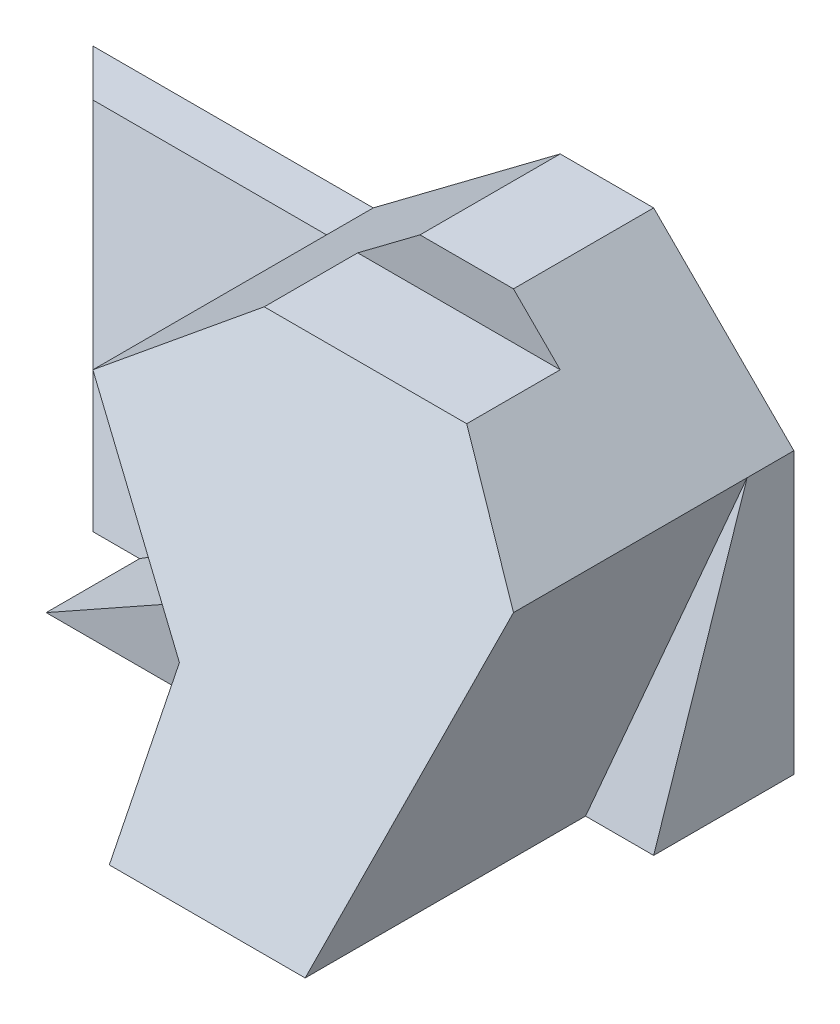
ISO-10303-21;
HEADER;
FILE_DESCRIPTION(('STEP AP214'),'2;1');
FILE_NAME('part.step','',(''),(''),'','','');
FILE_SCHEMA(('AUTOMOTIVE_DESIGN { 1 0 10303 214 1 1 1 1 }'));
ENDSEC;
DATA;
#1=APPLICATION_CONTEXT('core data for automotive mechanical design processes');
#2=APPLICATION_PROTOCOL_DEFINITION('international standard','automotive_design',2000,#1);
#3=PRODUCT_CONTEXT('',#1,'mechanical');
#4=PRODUCT('Part','Part','',(#3));
#5=PRODUCT_RELATED_PRODUCT_CATEGORY('part','',(#4));
#6=PRODUCT_DEFINITION_FORMATION('','',#4);
#7=PRODUCT_DEFINITION_CONTEXT('part definition',#1,'design');
#8=PRODUCT_DEFINITION('design','',#6,#7);
#9=PRODUCT_DEFINITION_SHAPE('','',#8);
#10=(LENGTH_UNIT() NAMED_UNIT(*) SI_UNIT(.MILLI.,.METRE.));
#11=(NAMED_UNIT(*) PLANE_ANGLE_UNIT() SI_UNIT($,.RADIAN.));
#12=(NAMED_UNIT(*) SI_UNIT($,.STERADIAN.) SOLID_ANGLE_UNIT());
#13=UNCERTAINTY_MEASURE_WITH_UNIT(LENGTH_MEASURE(1.E-05),#10,'distance_accuracy_value','');
#14=(GEOMETRIC_REPRESENTATION_CONTEXT(3) GLOBAL_UNCERTAINTY_ASSIGNED_CONTEXT((#13)) GLOBAL_UNIT_ASSIGNED_CONTEXT((#10,
#11,#12)) REPRESENTATION_CONTEXT('',''));
#15=CARTESIAN_POINT('',(0.,0.,0.));
#16=DIRECTION('',(0.,0.,1.));
#17=DIRECTION('',(1.,0.,0.));
#18=AXIS2_PLACEMENT_3D('',#15,#16,#17);
#19=CARTESIAN_POINT('',(0.,-4.5,9.));
#20=DIRECTION('',(0.,1.,0.));
#21=DIRECTION('',(0.,0.,1.));
#22=AXIS2_PLACEMENT_3D('',#19,#20,#21);
#23=PLANE('',#22);
#24=DIRECTION('',(0.,0.,1.));
#25=VECTOR('',#24,1.);
#26=CARTESIAN_POINT('',(1.85176640565367,-4.5,5.));
#27=LINE('',#26,#25);
#28=CARTESIAN_POINT('',(1.85176640565367,-4.5,5.));
#29=VERTEX_POINT('',#28);
#30=CARTESIAN_POINT('',(1.85176640565367,-4.5,9.));
#31=VERTEX_POINT('',#30);
#32=EDGE_CURVE('E286',#29,#31,#27,.T.);
#33=ORIENTED_EDGE('',*,*,#32,.F.);
#34=DIRECTION('',(1.,0.,0.));
#35=VECTOR('',#34,1.);
#36=CARTESIAN_POINT('',(0.,-4.5,5.));
#37=LINE('',#36,#35);
#38=CARTESIAN_POINT('',(-3.50000000000001,-4.5,5.));
#39=VERTEX_POINT('',#38);
#40=EDGE_CURVE('E293',#39,#29,#37,.T.);
#41=ORIENTED_EDGE('',*,*,#40,.F.);
#42=DIRECTION('',(0.,0.,1.));
#43=VECTOR('',#42,1.);
#44=CARTESIAN_POINT('',(-3.50000000000001,-4.5,3.));
#45=LINE('',#44,#43);
#46=CARTESIAN_POINT('',(-3.50000000000001,-4.5,3.));
#47=VERTEX_POINT('',#46);
#48=EDGE_CURVE('E188',#47,#39,#45,.T.);
#49=ORIENTED_EDGE('',*,*,#48,.F.);
#50=DIRECTION('',(1.,0.,0.));
#51=VECTOR('',#50,1.);
#52=CARTESIAN_POINT('',(-4.50000000000001,-4.5,3.));
#53=LINE('',#52,#51);
#54=CARTESIAN_POINT('',(-4.50000000000001,-4.5,3.));
#55=VERTEX_POINT('',#54);
#56=EDGE_CURVE('E158',#55,#47,#53,.T.);
#57=ORIENTED_EDGE('',*,*,#56,.F.);
#58=DIRECTION('',(0.707106781186548,0.,0.707106781186548));
#59=VECTOR('',#58,1.);
#60=CARTESIAN_POINT('',(-7.50000000000001,-4.5,0.));
#61=LINE('',#60,#59);
#62=CARTESIAN_POINT('',(-7.50000000000001,-4.5,0.));
#63=VERTEX_POINT('',#62);
#64=EDGE_CURVE('E140',#63,#55,#61,.T.);
#65=ORIENTED_EDGE('',*,*,#64,.F.);
#66=DIRECTION('',(1.,0.,0.));
#67=VECTOR('',#66,1.);
#68=CARTESIAN_POINT('',(0.,-4.5,0.));
#69=LINE('',#68,#67);
#70=CARTESIAN_POINT('',(7.49999999999999,-4.5,0.));
#71=VERTEX_POINT('',#70);
#72=EDGE_CURVE('E155',#63,#71,#69,.T.);
#73=ORIENTED_EDGE('',*,*,#72,.T.);
#74=DIRECTION('',(0.,0.,-1.));
#75=VECTOR('',#74,1.);
#76=CARTESIAN_POINT('',(7.49999999999999,-4.5,9.));
#77=LINE('',#76,#75);
#78=CARTESIAN_POINT('',(7.49999999999999,-4.5,3.));
#79=VERTEX_POINT('',#78);
#80=EDGE_CURVE('E43',#79,#71,#77,.T.);
#81=ORIENTED_EDGE('',*,*,#80,.F.);
#82=DIRECTION('',(-1.,0.,0.));
#83=VECTOR('',#82,1.);
#84=CARTESIAN_POINT('',(7.49999999999999,-4.5,3.));
#85=LINE('',#84,#83);
#86=CARTESIAN_POINT('',(6.04272144633455,-4.5,3.));
#87=VERTEX_POINT('',#86);
#88=EDGE_CURVE('E277',#79,#87,#85,.T.);
#89=ORIENTED_EDGE('',*,*,#88,.T.);
#90=DIRECTION('',(0.,0.,1.));
#91=VECTOR('',#90,1.);
#92=CARTESIAN_POINT('',(6.04272144633455,-4.5,3.));
#93=LINE('',#92,#91);
#94=CARTESIAN_POINT('',(6.04272144633455,-4.5,9.));
#95=VERTEX_POINT('',#94);
#96=EDGE_CURVE('E269',#87,#95,#93,.T.);
#97=ORIENTED_EDGE('',*,*,#96,.T.);
#98=DIRECTION('',(1.,0.,0.));
#99=VECTOR('',#98,1.);
#100=CARTESIAN_POINT('',(0.,-4.5,9.));
#101=LINE('',#100,#99);
#102=EDGE_CURVE('E168',#31,#95,#101,.T.);
#103=ORIENTED_EDGE('',*,*,#102,.F.);
#104=EDGE_LOOP('',(#33,#41,#49,#57,#65,#73,#81,#89,#97,#103));
#105=FACE_BOUND('',#104,.T.);
#106=ADVANCED_FACE('F39',(#105),#23,.F.);
#107=CARTESIAN_POINT('',(11.5,3.5,5.));
#108=DIRECTION('',(0.,-0.447213595499958,-0.894427190999916));
#109=DIRECTION('',(0.,0.894427190999916,-0.447213595499958));
#110=AXIS2_PLACEMENT_3D('',#107,#108,#109);
#111=PLANE('',#110);
#112=DIRECTION('',(0.,0.894427190999916,-0.447213595499958));
#113=VECTOR('',#112,1.);
#114=CARTESIAN_POINT('',(1.85176640565367,3.5,5.));
#115=LINE('',#114,#113);
#116=CARTESIAN_POINT('',(1.85176640565367,-1.5,7.5));
#117=VERTEX_POINT('',#116);
#118=EDGE_CURVE('E280',#31,#117,#115,.T.);
#119=ORIENTED_EDGE('',*,*,#118,.F.);
#120=ORIENTED_EDGE('',*,*,#102,.T.);
#121=DIRECTION('',(-0.212286835420554,-0.87404086838414,0.43702043419207));
#122=VECTOR('',#121,1.);
#123=CARTESIAN_POINT('',(8.14413122691524,4.15205807892426,4.67397096053787));
#124=LINE('',#123,#122);
#125=CARTESIAN_POINT('',(7.49999999999999,1.5,6.));
#126=VERTEX_POINT('',#125);
#127=EDGE_CURVE('E192',#126,#95,#124,.T.);
#128=ORIENTED_EDGE('',*,*,#127,.F.);
#129=DIRECTION('',(-0.666666666666667,0.666666666666667,-0.333333333333333));
#130=VECTOR('',#129,1.);
#131=CARTESIAN_POINT('',(5.49999999999999,3.5,5.));
#132=LINE('',#131,#130);
#133=CARTESIAN_POINT('',(5.49999999999999,3.5,5.));
#134=VERTEX_POINT('',#133);
#135=EDGE_CURVE('E227',#126,#134,#132,.T.);
#136=ORIENTED_EDGE('',*,*,#135,.T.);
#137=DIRECTION('',(-1.,0.,0.));
#138=VECTOR('',#137,1.);
#139=CARTESIAN_POINT('',(11.5,3.5,5.));
#140=LINE('',#139,#138);
#141=CARTESIAN_POINT('',(1.16666666666666,3.5,5.));
#142=VERTEX_POINT('',#141);
#143=EDGE_CURVE('E226',#134,#142,#140,.T.);
#144=ORIENTED_EDGE('',*,*,#143,.T.);
#145=DIRECTION('',(0.766261028176921,0.574695771132691,-0.287347885566345));
#146=VECTOR('',#145,1.);
#147=CARTESIAN_POINT('',(-1.94036697247707,1.1697247706422,6.1651376146789));
#148=LINE('',#147,#146);
#149=CARTESIAN_POINT('',(-1.50000000000001,1.5,6.));
#150=VERTEX_POINT('',#149);
#151=EDGE_CURVE('E219',#150,#142,#148,.T.);
#152=ORIENTED_EDGE('',*,*,#151,.F.);
#153=DIRECTION('',(0.706860462866664,-0.632675769117753,0.316337884558877));
#154=VECTOR('',#153,1.);
#155=CARTESIAN_POINT('',(3.87743856402521,-3.31307875896842,8.40653937948421));
#156=LINE('',#155,#154);
#157=EDGE_CURVE('E66',#150,#117,#156,.T.);
#158=ORIENTED_EDGE('',*,*,#157,.T.);
#159=EDGE_LOOP('',(#119,#120,#128,#136,#144,#152,#158));
#160=FACE_BOUND('',#159,.T.);
#161=ADVANCED_FACE('F311',(#160),#111,.F.);
#162=CARTESIAN_POINT('',(-3.50000000000001,-4.5,3.));
#163=DIRECTION('',(0.488976907666917,-0.87229672919741,0.));
#164=DIRECTION('',(0.87229672919741,0.488976907666917,0.));
#165=AXIS2_PLACEMENT_3D('',#162,#163,#164);
#166=PLANE('',#165);
#167=DIRECTION('',(-0.87229672919741,-0.488976907666917,0.));
#168=VECTOR('',#167,1.);
#169=CARTESIAN_POINT('',(1.08255385063887,-1.93119177672004,5.));
#170=LINE('',#169,#168);
#171=CARTESIAN_POINT('',(1.85176640565367,-1.5,5.));
#172=VERTEX_POINT('',#171);
#173=EDGE_CURVE('E296',#172,#39,#170,.T.);
#174=ORIENTED_EDGE('',*,*,#173,.F.);
#175=DIRECTION('',(0.,0.,1.));
#176=VECTOR('',#175,1.);
#177=CARTESIAN_POINT('',(1.85176640565367,-1.5,2.));
#178=LINE('',#177,#176);
#179=CARTESIAN_POINT('',(1.85176640565367,-1.5,2.));
#180=VERTEX_POINT('',#179);
#181=EDGE_CURVE('E12',#180,#172,#178,.T.);
#182=ORIENTED_EDGE('',*,*,#181,.F.);
#183=DIRECTION('',(0.860935670718548,0.48260832338032,-0.160869441126773));
#184=VECTOR('',#183,1.);
#185=CARTESIAN_POINT('',(-3.50000000000001,-4.5,3.));
#186=LINE('',#185,#184);
#187=EDGE_CURVE('E82',#47,#180,#186,.T.);
#188=ORIENTED_EDGE('',*,*,#187,.F.);
#189=ORIENTED_EDGE('',*,*,#48,.T.);
#190=EDGE_LOOP('',(#174,#182,#188,#189));
#191=FACE_BOUND('',#190,.T.);
#192=ADVANCED_FACE('F308',(#191),#166,.F.);
#193=CARTESIAN_POINT('',(7.49999999999999,0.,9.));
#194=DIRECTION('',(-1.,0.,0.));
#195=DIRECTION('',(0.,0.,1.));
#196=AXIS2_PLACEMENT_3D('',#193,#194,#195);
#197=PLANE('',#196);
#198=DIRECTION('',(0.,-0.948683298050514,0.316227766016838));
#199=VECTOR('',#198,1.);
#200=CARTESIAN_POINT('',(7.49999999999999,1.5,1.));
#201=LINE('',#200,#199);
#202=CARTESIAN_POINT('',(7.49999999999999,1.5,1.));
#203=VERTEX_POINT('',#202);
#204=EDGE_CURVE('E266',#203,#79,#201,.T.);
#205=ORIENTED_EDGE('',*,*,#204,.T.);
#206=ORIENTED_EDGE('',*,*,#80,.T.);
#207=DIRECTION('',(0.,1.,0.));
#208=VECTOR('',#207,1.);
#209=CARTESIAN_POINT('',(7.49999999999999,0.,0.));
#210=LINE('',#209,#208);
#211=CARTESIAN_POINT('',(7.49999999999999,1.5,0.));
#212=VERTEX_POINT('',#211);
#213=EDGE_CURVE('E165',#71,#212,#210,.T.);
#214=ORIENTED_EDGE('',*,*,#213,.T.);
#215=DIRECTION('',(0.,0.,-1.));
#216=VECTOR('',#215,1.);
#217=CARTESIAN_POINT('',(7.49999999999999,1.5,9.));
#218=LINE('',#217,#216);
#219=EDGE_CURVE('E198',#203,#212,#218,.T.);
#220=ORIENTED_EDGE('',*,*,#219,.F.);
#221=EDGE_LOOP('',(#205,#206,#214,#220));
#222=FACE_BOUND('',#221,.T.);
#223=ADVANCED_FACE('F310',(#222),#197,.F.);
#224=CARTESIAN_POINT('',(0.,1.5,9.));
#225=DIRECTION('',(0.,-1.,0.));
#226=DIRECTION('',(1.,0.,0.));
#227=AXIS2_PLACEMENT_3D('',#224,#225,#226);
#228=PLANE('',#227);
#229=DIRECTION('',(-1.,0.,0.));
#230=VECTOR('',#229,1.);
#231=CARTESIAN_POINT('',(-1.50000000000001,1.5,1.));
#232=LINE('',#231,#230);
#233=CARTESIAN_POINT('',(-1.50000000000001,1.5,1.));
#234=VERTEX_POINT('',#233);
#235=CARTESIAN_POINT('',(-6.50000000000001,1.5,1.));
#236=VERTEX_POINT('',#235);
#237=EDGE_CURVE('E250',#234,#236,#232,.T.);
#238=ORIENTED_EDGE('',*,*,#237,.F.);
#239=DIRECTION('',(0.,0.,-1.));
#240=VECTOR('',#239,1.);
#241=CARTESIAN_POINT('',(-1.50000000000001,1.5,9.));
#242=LINE('',#241,#240);
#243=CARTESIAN_POINT('',(-1.50000000000001,1.5,0.));
#244=VERTEX_POINT('',#243);
#245=EDGE_CURVE('E170',#234,#244,#242,.T.);
#246=ORIENTED_EDGE('',*,*,#245,.T.);
#247=DIRECTION('',(-1.,0.,0.));
#248=VECTOR('',#247,1.);
#249=CARTESIAN_POINT('',(0.,1.5,0.));
#250=LINE('',#249,#248);
#251=CARTESIAN_POINT('',(-7.50000000000001,1.5,0.));
#252=VERTEX_POINT('',#251);
#253=EDGE_CURVE('E166',#244,#252,#250,.T.);
#254=ORIENTED_EDGE('',*,*,#253,.T.);
#255=DIRECTION('',(-0.707106781186547,0.,-0.707106781186548));
#256=VECTOR('',#255,1.);
#257=CARTESIAN_POINT('',(-6.50000000000001,1.5,1.));
#258=LINE('',#257,#256);
#259=EDGE_CURVE('E143',#236,#252,#258,.T.);
#260=ORIENTED_EDGE('',*,*,#259,.F.);
#261=EDGE_LOOP('',(#238,#246,#254,#260));
#262=FACE_BOUND('',#261,.T.);
#263=ADVANCED_FACE('F41',(#262),#228,.F.);
#264=CARTESIAN_POINT('',(-1.26,1.68,9.));
#265=DIRECTION('',(0.6,-0.8,0.));
#266=DIRECTION('',(0.8,0.6,0.));
#267=AXIS2_PLACEMENT_3D('',#264,#265,#266);
#268=PLANE('',#267);
#269=EDGE_CURVE('E49',#150,#234,#242,.T.);
#270=ORIENTED_EDGE('',*,*,#269,.F.);
#271=ORIENTED_EDGE('',*,*,#151,.T.);
#272=DIRECTION('',(0.,0.,-1.));
#273=VECTOR('',#272,1.);
#274=CARTESIAN_POINT('',(1.16666666666666,3.5,9.));
#275=LINE('',#274,#273);
#276=CARTESIAN_POINT('',(1.16666666666666,3.5,3.));
#277=VERTEX_POINT('',#276);
#278=EDGE_CURVE('E216',#142,#277,#275,.T.);
#279=ORIENTED_EDGE('',*,*,#278,.T.);
#280=DIRECTION('',(0.8,0.6,0.));
#281=VECTOR('',#280,1.);
#282=CARTESIAN_POINT('',(-1.26,1.68,3.));
#283=LINE('',#282,#281);
#284=CARTESIAN_POINT('',(2.49999999999999,4.5,3.));
#285=VERTEX_POINT('',#284);
#286=EDGE_CURVE('E209',#277,#285,#283,.T.);
#287=ORIENTED_EDGE('',*,*,#286,.T.);
#288=DIRECTION('',(0.,0.,-1.));
#289=VECTOR('',#288,1.);
#290=CARTESIAN_POINT('',(2.49999999999999,4.5,9.));
#291=LINE('',#290,#289);
#292=CARTESIAN_POINT('',(2.49999999999999,4.5,0.));
#293=VERTEX_POINT('',#292);
#294=EDGE_CURVE('E206',#285,#293,#291,.T.);
#295=ORIENTED_EDGE('',*,*,#294,.T.);
#296=DIRECTION('',(-0.8,-0.6,0.));
#297=VECTOR('',#296,1.);
#298=CARTESIAN_POINT('',(-1.26,1.68,0.));
#299=LINE('',#298,#297);
#300=EDGE_CURVE('E208',#293,#244,#299,.T.);
#301=ORIENTED_EDGE('',*,*,#300,.T.);
#302=ORIENTED_EDGE('',*,*,#245,.F.);
#303=EDGE_LOOP('',(#270,#271,#279,#287,#295,#301,#302));
#304=FACE_BOUND('',#303,.T.);
#305=ADVANCED_FACE('F262',(#304),#268,.F.);
#306=CARTESIAN_POINT('',(4.5,4.5,9.));
#307=DIRECTION('',(0.707106781186547,0.707106781186547,0.));
#308=DIRECTION('',(-0.707106781186548,0.707106781186548,0.));
#309=AXIS2_PLACEMENT_3D('',#306,#307,#308);
#310=PLANE('',#309);
#311=ORIENTED_EDGE('',*,*,#135,.F.);
#312=EDGE_CURVE('E199',#126,#203,#218,.T.);
#313=ORIENTED_EDGE('',*,*,#312,.T.);
#314=ORIENTED_EDGE('',*,*,#219,.T.);
#315=DIRECTION('',(0.707106781186548,-0.707106781186548,0.));
#316=VECTOR('',#315,1.);
#317=CARTESIAN_POINT('',(4.5,4.5,0.));
#318=LINE('',#317,#316);
#319=CARTESIAN_POINT('',(4.49999999999999,4.5,0.));
#320=VERTEX_POINT('',#319);
#321=EDGE_CURVE('E149',#320,#212,#318,.T.);
#322=ORIENTED_EDGE('',*,*,#321,.F.);
#323=DIRECTION('',(0.,0.,-1.));
#324=VECTOR('',#323,1.);
#325=CARTESIAN_POINT('',(4.49999999999999,4.5,9.));
#326=LINE('',#325,#324);
#327=CARTESIAN_POINT('',(4.49999999999999,4.5,3.));
#328=VERTEX_POINT('',#327);
#329=EDGE_CURVE('E202',#328,#320,#326,.T.);
#330=ORIENTED_EDGE('',*,*,#329,.F.);
#331=DIRECTION('',(-0.707106781186548,0.707106781186548,0.));
#332=VECTOR('',#331,1.);
#333=CARTESIAN_POINT('',(4.5,4.5,3.));
#334=LINE('',#333,#332);
#335=CARTESIAN_POINT('',(5.49999999999999,3.5,3.));
#336=VERTEX_POINT('',#335);
#337=EDGE_CURVE('E222',#336,#328,#334,.T.);
#338=ORIENTED_EDGE('',*,*,#337,.F.);
#339=DIRECTION('',(0.,0.,-1.));
#340=VECTOR('',#339,1.);
#341=CARTESIAN_POINT('',(5.49999999999999,3.5,9.));
#342=LINE('',#341,#340);
#343=EDGE_CURVE('E148',#134,#336,#342,.T.);
#344=ORIENTED_EDGE('',*,*,#343,.F.);
#345=EDGE_LOOP('',(#311,#313,#314,#322,#330,#338,#344));
#346=FACE_BOUND('',#345,.T.);
#347=ADVANCED_FACE('F353',(#346),#310,.T.);
#348=CARTESIAN_POINT('',(0.,4.5,9.));
#349=DIRECTION('',(0.,1.,0.));
#350=DIRECTION('',(0.,0.,1.));
#351=AXIS2_PLACEMENT_3D('',#348,#349,#350);
#352=PLANE('',#351);
#353=DIRECTION('',(-1.,0.,0.));
#354=VECTOR('',#353,1.);
#355=CARTESIAN_POINT('',(11.5,4.5,3.));
#356=LINE('',#355,#354);
#357=EDGE_CURVE('E191',#328,#285,#356,.T.);
#358=ORIENTED_EDGE('',*,*,#357,.F.);
#359=ORIENTED_EDGE('',*,*,#329,.T.);
#360=DIRECTION('',(1.,0.,0.));
#361=VECTOR('',#360,1.);
#362=CARTESIAN_POINT('',(0.,4.5,0.));
#363=LINE('',#362,#361);
#364=EDGE_CURVE('E205',#293,#320,#363,.T.);
#365=ORIENTED_EDGE('',*,*,#364,.F.);
#366=ORIENTED_EDGE('',*,*,#294,.F.);
#367=EDGE_LOOP('',(#358,#359,#365,#366));
#368=FACE_BOUND('',#367,.T.);
#369=ADVANCED_FACE('F350',(#368),#352,.T.);
#370=CARTESIAN_POINT('',(0.,0.,0.));
#371=DIRECTION('',(0.,0.,1.));
#372=DIRECTION('',(1.,0.,0.));
#373=AXIS2_PLACEMENT_3D('',#370,#371,#372);
#374=PLANE('',#373);
#375=ORIENTED_EDGE('',*,*,#300,.F.);
#376=ORIENTED_EDGE('',*,*,#364,.T.);
#377=ORIENTED_EDGE('',*,*,#321,.T.);
#378=ORIENTED_EDGE('',*,*,#213,.F.);
#379=ORIENTED_EDGE('',*,*,#72,.F.);
#380=DIRECTION('',(0.,1.,0.));
#381=VECTOR('',#380,1.);
#382=CARTESIAN_POINT('',(-7.50000000000001,0.,0.));
#383=LINE('',#382,#381);
#384=EDGE_CURVE('E137',#63,#252,#383,.T.);
#385=ORIENTED_EDGE('',*,*,#384,.T.);
#386=ORIENTED_EDGE('',*,*,#253,.F.);
#387=EDGE_LOOP('',(#375,#376,#377,#378,#379,#385,#386));
#388=FACE_BOUND('',#387,.T.);
#389=ADVANCED_FACE('F162',(#388),#374,.F.);
#390=CARTESIAN_POINT('',(11.5,3.5,3.));
#391=DIRECTION('',(0.,-1.,0.));
#392=DIRECTION('',(0.,0.,-1.));
#393=AXIS2_PLACEMENT_3D('',#390,#391,#392);
#394=PLANE('',#393);
#395=ORIENTED_EDGE('',*,*,#143,.F.);
#396=ORIENTED_EDGE('',*,*,#343,.T.);
#397=DIRECTION('',(-1.,0.,0.));
#398=VECTOR('',#397,1.);
#399=CARTESIAN_POINT('',(11.5,3.5,3.));
#400=LINE('',#399,#398);
#401=EDGE_CURVE('E180',#336,#277,#400,.T.);
#402=ORIENTED_EDGE('',*,*,#401,.T.);
#403=ORIENTED_EDGE('',*,*,#278,.F.);
#404=EDGE_LOOP('',(#395,#396,#402,#403));
#405=FACE_BOUND('',#404,.T.);
#406=ADVANCED_FACE('F341',(#405),#394,.F.);
#407=CARTESIAN_POINT('',(11.5,4.5,3.));
#408=DIRECTION('',(0.,0.,-1.));
#409=DIRECTION('',(-1.,0.,0.));
#410=AXIS2_PLACEMENT_3D('',#407,#408,#409);
#411=PLANE('',#410);
#412=ORIENTED_EDGE('',*,*,#401,.F.);
#413=ORIENTED_EDGE('',*,*,#337,.T.);
#414=ORIENTED_EDGE('',*,*,#357,.T.);
#415=ORIENTED_EDGE('',*,*,#286,.F.);
#416=EDGE_LOOP('',(#412,#413,#414,#415));
#417=FACE_BOUND('',#416,.T.);
#418=ADVANCED_FACE('F338',(#417),#411,.F.);
#419=CARTESIAN_POINT('',(-3.75,0.,3.75));
#420=DIRECTION('',(-0.707106781186548,0.,0.707106781186547));
#421=DIRECTION('',(0.707106781186547,0.,0.707106781186548));
#422=AXIS2_PLACEMENT_3D('',#419,#420,#421);
#423=PLANE('',#422);
#424=DIRECTION('',(-0.301511344577764,0.904534033733291,-0.301511344577764));
#425=VECTOR('',#424,1.);
#426=CARTESIAN_POINT('',(-4.50000000000001,-4.5,3.));
#427=LINE('',#426,#425);
#428=EDGE_CURVE('E91',#55,#236,#427,.T.);
#429=ORIENTED_EDGE('',*,*,#428,.T.);
#430=ORIENTED_EDGE('',*,*,#259,.T.);
#431=ORIENTED_EDGE('',*,*,#384,.F.);
#432=ORIENTED_EDGE('',*,*,#64,.T.);
#433=EDGE_LOOP('',(#429,#430,#431,#432));
#434=FACE_BOUND('',#433,.T.);
#435=ADVANCED_FACE('F139',(#434),#423,.T.);
#436=CARTESIAN_POINT('',(0.,0.45,1.34999999999999));
#437=DIRECTION('',(0.,0.316227766016839,0.948683298050513));
#438=DIRECTION('',(0.,-0.948683298050513,0.316227766016839));
#439=AXIS2_PLACEMENT_3D('',#436,#437,#438);
#440=PLANE('',#439);
#441=DIRECTION('',(-0.727368317697291,0.651031333630872,-0.217010444543624));
#442=VECTOR('',#441,1.);
#443=CARTESIAN_POINT('',(1.85176640565367,-1.5,2.));
#444=LINE('',#443,#442);
#445=EDGE_CURVE('E159',#180,#234,#444,.T.);
#446=ORIENTED_EDGE('',*,*,#445,.T.);
#447=ORIENTED_EDGE('',*,*,#237,.T.);
#448=ORIENTED_EDGE('',*,*,#428,.F.);
#449=ORIENTED_EDGE('',*,*,#56,.T.);
#450=ORIENTED_EDGE('',*,*,#187,.T.);
#451=EDGE_LOOP('',(#446,#447,#448,#449,#450));
#452=FACE_BOUND('',#451,.T.);
#453=ADVANCED_FACE('F257',(#452),#440,.T.);
#454=CARTESIAN_POINT('',(1.85176640565367,-1.5,2.));
#455=DIRECTION('',(0.66692462638464,0.745125185939724,0.));
#456=DIRECTION('',(-0.745125185939724,0.66692462638464,0.));
#457=AXIS2_PLACEMENT_3D('',#454,#455,#456);
#458=PLANE('',#457);
#459=ORIENTED_EDGE('',*,*,#269,.T.);
#460=ORIENTED_EDGE('',*,*,#445,.F.);
#461=ORIENTED_EDGE('',*,*,#181,.T.);
#462=DIRECTION('',(0.,0.,1.));
#463=VECTOR('',#462,1.);
#464=CARTESIAN_POINT('',(1.85176640565367,-1.5,5.));
#465=LINE('',#464,#463);
#466=EDGE_CURVE('E285',#172,#117,#465,.T.);
#467=ORIENTED_EDGE('',*,*,#466,.T.);
#468=ORIENTED_EDGE('',*,*,#157,.F.);
#469=EDGE_LOOP('',(#459,#460,#461,#467,#468));
#470=FACE_BOUND('',#469,.T.);
#471=ADVANCED_FACE('F326',(#470),#458,.F.);
#472=CARTESIAN_POINT('',(6.04272144633455,-4.5,3.));
#473=DIRECTION('',(0.971748663674171,-0.23601808118757,0.));
#474=DIRECTION('',(0.23601808118757,0.971748663674171,0.));
#475=AXIS2_PLACEMENT_3D('',#472,#473,#474);
#476=PLANE('',#475);
#477=ORIENTED_EDGE('',*,*,#127,.T.);
#478=ORIENTED_EDGE('',*,*,#96,.F.);
#479=DIRECTION('',(0.224532659364576,0.924460154030883,-0.308153384676961));
#480=VECTOR('',#479,1.);
#481=CARTESIAN_POINT('',(6.04272144633455,-4.5,3.));
#482=LINE('',#481,#480);
#483=EDGE_CURVE('E57',#87,#203,#482,.T.);
#484=ORIENTED_EDGE('',*,*,#483,.T.);
#485=ORIENTED_EDGE('',*,*,#312,.F.);
#486=EDGE_LOOP('',(#477,#478,#484,#485));
#487=FACE_BOUND('',#486,.T.);
#488=ADVANCED_FACE('F328',(#487),#476,.T.);
#489=CARTESIAN_POINT('',(0.,0.450000000000004,1.35000000000001));
#490=DIRECTION('',(0.,0.316227766016838,0.948683298050514));
#491=DIRECTION('',(0.,-0.948683298050514,0.316227766016838));
#492=AXIS2_PLACEMENT_3D('',#489,#490,#491);
#493=PLANE('',#492);
#494=ORIENTED_EDGE('',*,*,#483,.F.);
#495=ORIENTED_EDGE('',*,*,#88,.F.);
#496=ORIENTED_EDGE('',*,*,#204,.F.);
#497=EDGE_LOOP('',(#494,#495,#496));
#498=FACE_BOUND('',#497,.T.);
#499=ADVANCED_FACE('F333',(#498),#493,.T.);
#500=CARTESIAN_POINT('',(1.85176640565367,0.,5.));
#501=DIRECTION('',(-1.,0.,0.));
#502=DIRECTION('',(0.,-1.,0.));
#503=AXIS2_PLACEMENT_3D('',#500,#501,#502);
#504=PLANE('',#503);
#505=ORIENTED_EDGE('',*,*,#118,.T.);
#506=ORIENTED_EDGE('',*,*,#466,.F.);
#507=DIRECTION('',(0.,-1.,0.));
#508=VECTOR('',#507,1.);
#509=CARTESIAN_POINT('',(1.85176640565367,0.,5.));
#510=LINE('',#509,#508);
#511=EDGE_CURVE('E289',#172,#29,#510,.T.);
#512=ORIENTED_EDGE('',*,*,#511,.T.);
#513=ORIENTED_EDGE('',*,*,#32,.T.);
#514=EDGE_LOOP('',(#505,#506,#512,#513));
#515=FACE_BOUND('',#514,.T.);
#516=ADVANCED_FACE('F361',(#515),#504,.T.);
#517=CARTESIAN_POINT('',(0.,0.,5.));
#518=DIRECTION('',(0.,0.,1.));
#519=DIRECTION('',(1.,0.,0.));
#520=AXIS2_PLACEMENT_3D('',#517,#518,#519);
#521=PLANE('',#520);
#522=ORIENTED_EDGE('',*,*,#173,.T.);
#523=ORIENTED_EDGE('',*,*,#40,.T.);
#524=ORIENTED_EDGE('',*,*,#511,.F.);
#525=EDGE_LOOP('',(#522,#523,#524));
#526=FACE_BOUND('',#525,.T.);
#527=ADVANCED_FACE('F303',(#526),#521,.T.);
#528=CLOSED_SHELL('',(#106,#161,#192,#223,#263,#305,#347,#369,#389,#406,#418,#435,#453,#471,
#488,#499,#516,#527));
#529=MANIFOLD_SOLID_BREP('B2',#528);
#530=ADVANCED_BREP_SHAPE_REPRESENTATION('',(#18,#529),#14);
#531=SHAPE_DEFINITION_REPRESENTATION(#9,#530);
ENDSEC;
END-ISO-10303-21;
